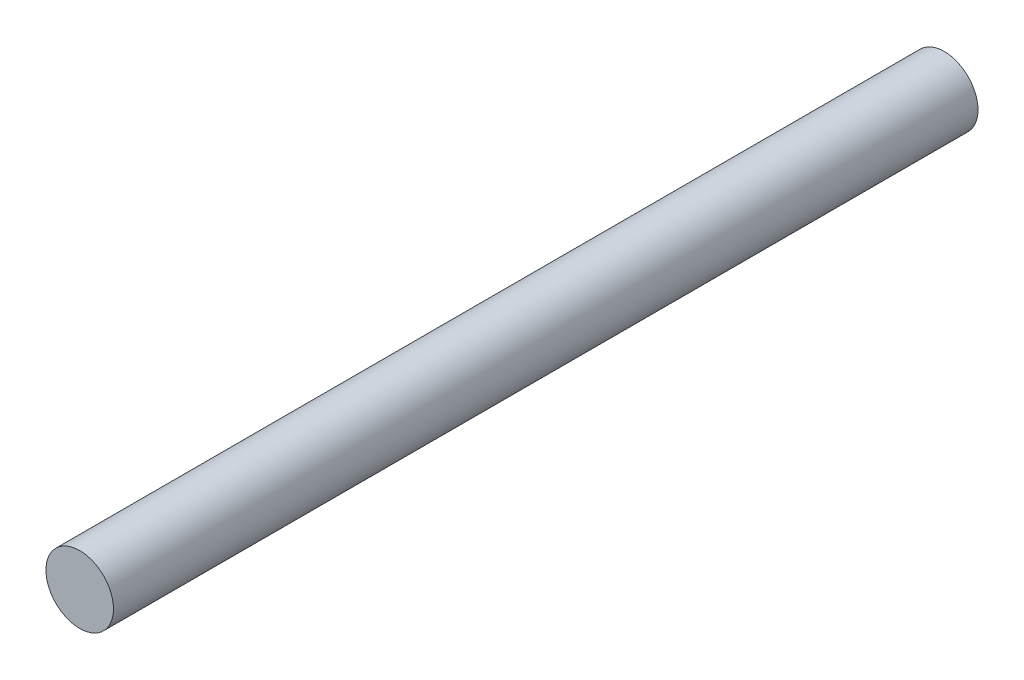
ISO-10303-21;
HEADER;
FILE_DESCRIPTION(('STEP AP214'),'2;1');
FILE_NAME('part.step','',(''),(''),'','','');
FILE_SCHEMA(('AUTOMOTIVE_DESIGN { 1 0 10303 214 1 1 1 1 }'));
ENDSEC;
DATA;
#1=APPLICATION_CONTEXT('core data for automotive mechanical design processes');
#2=APPLICATION_PROTOCOL_DEFINITION('international standard','automotive_design',2000,#1);
#3=PRODUCT_CONTEXT('',#1,'mechanical');
#4=PRODUCT('Part','Part','',(#3));
#5=PRODUCT_RELATED_PRODUCT_CATEGORY('part','',(#4));
#6=PRODUCT_DEFINITION_FORMATION('','',#4);
#7=PRODUCT_DEFINITION_CONTEXT('part definition',#1,'design');
#8=PRODUCT_DEFINITION('design','',#6,#7);
#9=PRODUCT_DEFINITION_SHAPE('','',#8);
#10=(LENGTH_UNIT() NAMED_UNIT(*) SI_UNIT(.MILLI.,.METRE.));
#11=(NAMED_UNIT(*) PLANE_ANGLE_UNIT() SI_UNIT($,.RADIAN.));
#12=(NAMED_UNIT(*) SI_UNIT($,.STERADIAN.) SOLID_ANGLE_UNIT());
#13=UNCERTAINTY_MEASURE_WITH_UNIT(LENGTH_MEASURE(1.E-05),#10,'distance_accuracy_value','');
#14=(GEOMETRIC_REPRESENTATION_CONTEXT(3) GLOBAL_UNCERTAINTY_ASSIGNED_CONTEXT((#13)) GLOBAL_UNIT_ASSIGNED_CONTEXT((#10,
#11,#12)) REPRESENTATION_CONTEXT('',''));
#15=CARTESIAN_POINT('',(0.,0.,0.));
#16=DIRECTION('',(0.,0.,1.));
#17=DIRECTION('',(1.,0.,0.));
#18=AXIS2_PLACEMENT_3D('',#15,#16,#17);
#19=CARTESIAN_POINT('',(0.,0.,20.32));
#20=DIRECTION('',(0.,0.,-1.));
#21=DIRECTION('',(-1.,0.,0.));
#22=AXIS2_PLACEMENT_3D('',#19,#20,#21);
#23=CYLINDRICAL_SURFACE('',#22,1.5875);
#24=CARTESIAN_POINT('',(0.,0.,20.32));
#25=DIRECTION('',(0.,0.,1.));
#26=DIRECTION('',(1.,0.,0.));
#27=AXIS2_PLACEMENT_3D('',#24,#25,#26);
#28=CIRCLE('',#27,1.5875);
#29=CARTESIAN_POINT('',(1.5875,0.,20.32));
#30=VERTEX_POINT('',#29);
#31=EDGE_CURVE('E10',#30,#30,#28,.T.);
#32=ORIENTED_EDGE('',*,*,#31,.F.);
#33=EDGE_LOOP('',(#32));
#34=FACE_BOUND('',#33,.T.);
#35=CARTESIAN_POINT('',(0.,0.,-20.32));
#36=DIRECTION('',(0.,0.,1.));
#37=DIRECTION('',(1.,0.,0.));
#38=AXIS2_PLACEMENT_3D('',#35,#36,#37);
#39=CIRCLE('',#38,1.5875);
#40=CARTESIAN_POINT('',(1.5875,0.,-20.32));
#41=VERTEX_POINT('',#40);
#42=EDGE_CURVE('E44',#41,#41,#39,.T.);
#43=ORIENTED_EDGE('',*,*,#42,.T.);
#44=EDGE_LOOP('',(#43));
#45=FACE_BOUND('',#44,.T.);
#46=ADVANCED_FACE('F41',(#34,#45),#23,.T.);
#47=CARTESIAN_POINT('',(0.,0.,20.32));
#48=DIRECTION('',(0.,0.,1.));
#49=DIRECTION('',(1.,0.,0.));
#50=AXIS2_PLACEMENT_3D('',#47,#48,#49);
#51=PLANE('',#50);
#52=ORIENTED_EDGE('',*,*,#31,.T.);
#53=EDGE_LOOP('',(#52));
#54=FACE_BOUND('',#53,.T.);
#55=ADVANCED_FACE('F58',(#54),#51,.T.);
#56=CARTESIAN_POINT('',(0.,0.,-20.32));
#57=DIRECTION('',(0.,0.,1.));
#58=DIRECTION('',(1.,0.,0.));
#59=AXIS2_PLACEMENT_3D('',#56,#57,#58);
#60=PLANE('',#59);
#61=ORIENTED_EDGE('',*,*,#42,.F.);
#62=EDGE_LOOP('',(#61));
#63=FACE_BOUND('',#62,.T.);
#64=ADVANCED_FACE('F56',(#63),#60,.F.);
#65=CLOSED_SHELL('',(#46,#55,#64));
#66=MANIFOLD_SOLID_BREP('B2',#65);
#67=ADVANCED_BREP_SHAPE_REPRESENTATION('',(#18,#66),#14);
#68=SHAPE_DEFINITION_REPRESENTATION(#9,#67);
ENDSEC;
END-ISO-10303-21;
